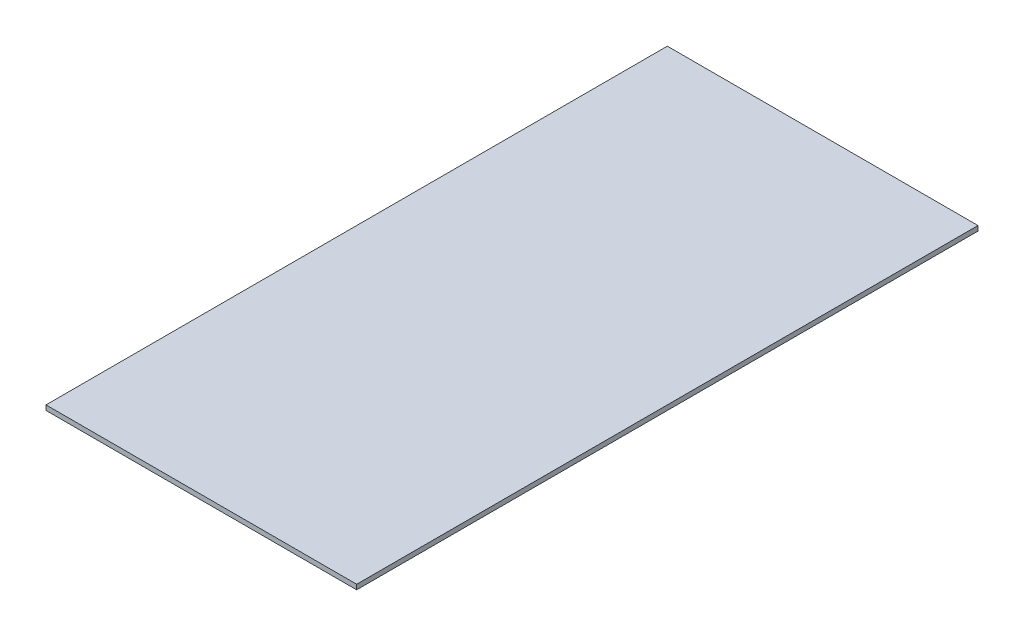
ISO-10303-21;
HEADER;
FILE_DESCRIPTION(('STEP AP214'),'2;1');
FILE_NAME('part.step','',(''),(''),'','','');
FILE_SCHEMA(('AUTOMOTIVE_DESIGN { 1 0 10303 214 1 1 1 1 }'));
ENDSEC;
DATA;
#1=APPLICATION_CONTEXT('core data for automotive mechanical design processes');
#2=APPLICATION_PROTOCOL_DEFINITION('international standard','automotive_design',2000,#1);
#3=PRODUCT_CONTEXT('',#1,'mechanical');
#4=PRODUCT('Part','Part','',(#3));
#5=PRODUCT_RELATED_PRODUCT_CATEGORY('part','',(#4));
#6=PRODUCT_DEFINITION_FORMATION('','',#4);
#7=PRODUCT_DEFINITION_CONTEXT('part definition',#1,'design');
#8=PRODUCT_DEFINITION('design','',#6,#7);
#9=PRODUCT_DEFINITION_SHAPE('','',#8);
#10=(LENGTH_UNIT() NAMED_UNIT(*) SI_UNIT(.MILLI.,.METRE.));
#11=(NAMED_UNIT(*) PLANE_ANGLE_UNIT() SI_UNIT($,.RADIAN.));
#12=(NAMED_UNIT(*) SI_UNIT($,.STERADIAN.) SOLID_ANGLE_UNIT());
#13=UNCERTAINTY_MEASURE_WITH_UNIT(LENGTH_MEASURE(1.E-05),#10,'distance_accuracy_value','');
#14=(GEOMETRIC_REPRESENTATION_CONTEXT(3) GLOBAL_UNCERTAINTY_ASSIGNED_CONTEXT((#13)) GLOBAL_UNIT_ASSIGNED_CONTEXT((#10,
#11,#12)) REPRESENTATION_CONTEXT('',''));
#15=CARTESIAN_POINT('',(0.,0.,0.));
#16=DIRECTION('',(0.,0.,1.));
#17=DIRECTION('',(1.,0.,0.));
#18=AXIS2_PLACEMENT_3D('',#15,#16,#17);
#19=CARTESIAN_POINT('',(0.,3.175,0.));
#20=DIRECTION('',(-1.,0.,0.));
#21=DIRECTION('',(0.,0.,1.));
#22=AXIS2_PLACEMENT_3D('',#19,#20,#21);
#23=PLANE('',#22);
#24=DIRECTION('',(0.,0.,-1.));
#25=VECTOR('',#24,1.);
#26=CARTESIAN_POINT('',(0.,0.,0.));
#27=LINE('',#26,#25);
#28=CARTESIAN_POINT('',(0.,0.,406.4));
#29=VERTEX_POINT('',#28);
#30=CARTESIAN_POINT('',(0.,0.,0.));
#31=VERTEX_POINT('',#30);
#32=EDGE_CURVE('E96',#29,#31,#27,.T.);
#33=ORIENTED_EDGE('',*,*,#32,.T.);
#34=DIRECTION('',(0.,-1.,0.));
#35=VECTOR('',#34,1.);
#36=CARTESIAN_POINT('',(0.,3.175,0.));
#37=LINE('',#36,#35);
#38=CARTESIAN_POINT('',(0.,3.175,0.));
#39=VERTEX_POINT('',#38);
#40=EDGE_CURVE('E11',#39,#31,#37,.T.);
#41=ORIENTED_EDGE('',*,*,#40,.F.);
#42=DIRECTION('',(0.,0.,-1.));
#43=VECTOR('',#42,1.);
#44=CARTESIAN_POINT('',(0.,3.175,0.));
#45=LINE('',#44,#43);
#46=CARTESIAN_POINT('',(0.,3.175,406.4));
#47=VERTEX_POINT('',#46);
#48=EDGE_CURVE('E84',#47,#39,#45,.T.);
#49=ORIENTED_EDGE('',*,*,#48,.F.);
#50=DIRECTION('',(0.,-1.,0.));
#51=VECTOR('',#50,1.);
#52=CARTESIAN_POINT('',(0.,3.175,406.4));
#53=LINE('',#52,#51);
#54=EDGE_CURVE('E92',#47,#29,#53,.T.);
#55=ORIENTED_EDGE('',*,*,#54,.T.);
#56=EDGE_LOOP('',(#33,#41,#49,#55));
#57=FACE_BOUND('',#56,.T.);
#58=ADVANCED_FACE('F33',(#57),#23,.F.);
#59=CARTESIAN_POINT('',(0.,3.175,0.));
#60=DIRECTION('',(0.,0.,1.));
#61=DIRECTION('',(1.,0.,0.));
#62=AXIS2_PLACEMENT_3D('',#59,#60,#61);
#63=PLANE('',#62);
#64=DIRECTION('',(-1.,0.,0.));
#65=VECTOR('',#64,1.);
#66=CARTESIAN_POINT('',(0.,0.,0.));
#67=LINE('',#66,#65);
#68=CARTESIAN_POINT('',(-203.2,0.,0.));
#69=VERTEX_POINT('',#68);
#70=EDGE_CURVE('E88',#31,#69,#67,.T.);
#71=ORIENTED_EDGE('',*,*,#70,.T.);
#72=DIRECTION('',(0.,-1.,0.));
#73=VECTOR('',#72,1.);
#74=CARTESIAN_POINT('',(-203.2,3.175,0.));
#75=LINE('',#74,#73);
#76=CARTESIAN_POINT('',(-203.2,3.175,0.));
#77=VERTEX_POINT('',#76);
#78=EDGE_CURVE('E41',#77,#69,#75,.T.);
#79=ORIENTED_EDGE('',*,*,#78,.F.);
#80=DIRECTION('',(-1.,0.,0.));
#81=VECTOR('',#80,1.);
#82=CARTESIAN_POINT('',(0.,3.175,0.));
#83=LINE('',#82,#81);
#84=EDGE_CURVE('E79',#39,#77,#83,.T.);
#85=ORIENTED_EDGE('',*,*,#84,.F.);
#86=ORIENTED_EDGE('',*,*,#40,.T.);
#87=EDGE_LOOP('',(#71,#79,#85,#86));
#88=FACE_BOUND('',#87,.T.);
#89=ADVANCED_FACE('F87',(#88),#63,.F.);
#90=CARTESIAN_POINT('',(-203.2,3.175,0.));
#91=DIRECTION('',(1.,0.,0.));
#92=DIRECTION('',(0.,0.,-1.));
#93=AXIS2_PLACEMENT_3D('',#90,#91,#92);
#94=PLANE('',#93);
#95=DIRECTION('',(0.,0.,1.));
#96=VECTOR('',#95,1.);
#97=CARTESIAN_POINT('',(-203.2,0.,0.));
#98=LINE('',#97,#96);
#99=CARTESIAN_POINT('',(-203.2,0.,406.4));
#100=VERTEX_POINT('',#99);
#101=EDGE_CURVE('E66',#69,#100,#98,.T.);
#102=ORIENTED_EDGE('',*,*,#101,.T.);
#103=DIRECTION('',(0.,-1.,0.));
#104=VECTOR('',#103,1.);
#105=CARTESIAN_POINT('',(-203.2,3.175,406.4));
#106=LINE('',#105,#104);
#107=CARTESIAN_POINT('',(-203.2,3.175,406.4));
#108=VERTEX_POINT('',#107);
#109=EDGE_CURVE('E89',#108,#100,#106,.T.);
#110=ORIENTED_EDGE('',*,*,#109,.F.);
#111=DIRECTION('',(0.,0.,1.));
#112=VECTOR('',#111,1.);
#113=CARTESIAN_POINT('',(-203.2,3.175,0.));
#114=LINE('',#113,#112);
#115=EDGE_CURVE('E82',#77,#108,#114,.T.);
#116=ORIENTED_EDGE('',*,*,#115,.F.);
#117=ORIENTED_EDGE('',*,*,#78,.T.);
#118=EDGE_LOOP('',(#102,#110,#116,#117));
#119=FACE_BOUND('',#118,.T.);
#120=ADVANCED_FACE('F90',(#119),#94,.F.);
#121=CARTESIAN_POINT('',(0.,3.175,406.4));
#122=DIRECTION('',(0.,0.,-1.));
#123=DIRECTION('',(-1.,0.,0.));
#124=AXIS2_PLACEMENT_3D('',#121,#122,#123);
#125=PLANE('',#124);
#126=DIRECTION('',(1.,0.,0.));
#127=VECTOR('',#126,1.);
#128=CARTESIAN_POINT('',(0.,0.,406.4));
#129=LINE('',#128,#127);
#130=EDGE_CURVE('E72',#100,#29,#129,.T.);
#131=ORIENTED_EDGE('',*,*,#130,.T.);
#132=ORIENTED_EDGE('',*,*,#54,.F.);
#133=DIRECTION('',(1.,0.,0.));
#134=VECTOR('',#133,1.);
#135=CARTESIAN_POINT('',(0.,3.175,406.4));
#136=LINE('',#135,#134);
#137=EDGE_CURVE('E49',#108,#47,#136,.T.);
#138=ORIENTED_EDGE('',*,*,#137,.F.);
#139=ORIENTED_EDGE('',*,*,#109,.T.);
#140=EDGE_LOOP('',(#131,#132,#138,#139));
#141=FACE_BOUND('',#140,.T.);
#142=ADVANCED_FACE('F103',(#141),#125,.F.);
#143=CARTESIAN_POINT('',(0.,3.175,0.));
#144=DIRECTION('',(0.,-1.,0.));
#145=DIRECTION('',(0.,0.,-1.));
#146=AXIS2_PLACEMENT_3D('',#143,#144,#145);
#147=PLANE('',#146);
#148=ORIENTED_EDGE('',*,*,#48,.T.);
#149=ORIENTED_EDGE('',*,*,#84,.T.);
#150=ORIENTED_EDGE('',*,*,#115,.T.);
#151=ORIENTED_EDGE('',*,*,#137,.T.);
#152=EDGE_LOOP('',(#148,#149,#150,#151));
#153=FACE_BOUND('',#152,.T.);
#154=ADVANCED_FACE('F80',(#153),#147,.F.);
#155=CARTESIAN_POINT('',(0.,0.,0.));
#156=DIRECTION('',(0.,-1.,0.));
#157=DIRECTION('',(0.,0.,-1.));
#158=AXIS2_PLACEMENT_3D('',#155,#156,#157);
#159=PLANE('',#158);
#160=ORIENTED_EDGE('',*,*,#32,.F.);
#161=ORIENTED_EDGE('',*,*,#130,.F.);
#162=ORIENTED_EDGE('',*,*,#101,.F.);
#163=ORIENTED_EDGE('',*,*,#70,.F.);
#164=EDGE_LOOP('',(#160,#161,#162,#163));
#165=FACE_BOUND('',#164,.T.);
#166=ADVANCED_FACE('F106',(#165),#159,.T.);
#167=CLOSED_SHELL('',(#58,#89,#120,#142,#154,#166));
#168=MANIFOLD_SOLID_BREP('B2',#167);
#169=ADVANCED_BREP_SHAPE_REPRESENTATION('',(#18,#168),#14);
#170=SHAPE_DEFINITION_REPRESENTATION(#9,#169);
ENDSEC;
END-ISO-10303-21;
